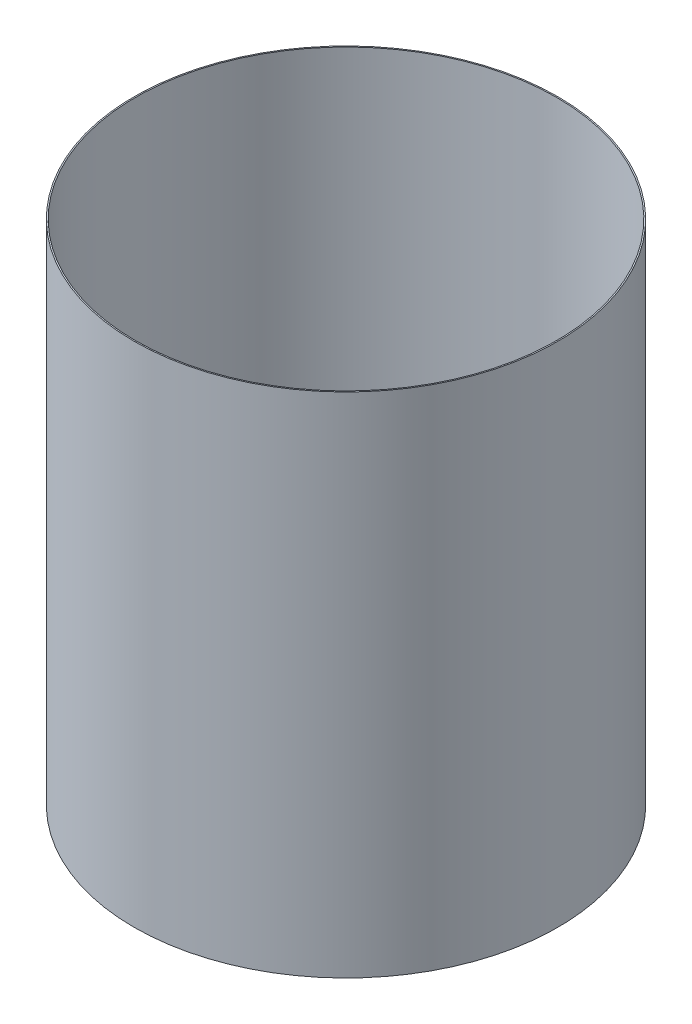
ISO-10303-21;
HEADER;
FILE_DESCRIPTION(('STEP AP214'),'2;1');
FILE_NAME('part.step','',(''),(''),'','','');
FILE_SCHEMA(('AUTOMOTIVE_DESIGN { 1 0 10303 214 1 1 1 1 }'));
ENDSEC;
DATA;
#1=APPLICATION_CONTEXT('core data for automotive mechanical design processes');
#2=APPLICATION_PROTOCOL_DEFINITION('international standard','automotive_design',2000,#1);
#3=PRODUCT_CONTEXT('',#1,'mechanical');
#4=PRODUCT('Part','Part','',(#3));
#5=PRODUCT_RELATED_PRODUCT_CATEGORY('part','',(#4));
#6=PRODUCT_DEFINITION_FORMATION('','',#4);
#7=PRODUCT_DEFINITION_CONTEXT('part definition',#1,'design');
#8=PRODUCT_DEFINITION('design','',#6,#7);
#9=PRODUCT_DEFINITION_SHAPE('','',#8);
#10=(LENGTH_UNIT() NAMED_UNIT(*) SI_UNIT(.MILLI.,.METRE.));
#11=(NAMED_UNIT(*) PLANE_ANGLE_UNIT() SI_UNIT($,.RADIAN.));
#12=(NAMED_UNIT(*) SI_UNIT($,.STERADIAN.) SOLID_ANGLE_UNIT());
#13=UNCERTAINTY_MEASURE_WITH_UNIT(LENGTH_MEASURE(1.E-05),#10,'distance_accuracy_value','');
#14=(GEOMETRIC_REPRESENTATION_CONTEXT(3) GLOBAL_UNCERTAINTY_ASSIGNED_CONTEXT((#13)) GLOBAL_UNIT_ASSIGNED_CONTEXT((#10,
#11,#12)) REPRESENTATION_CONTEXT('',''));
#15=CARTESIAN_POINT('',(0.,0.,0.));
#16=DIRECTION('',(0.,0.,1.));
#17=DIRECTION('',(1.,0.,0.));
#18=AXIS2_PLACEMENT_3D('',#15,#16,#17);
#19=CARTESIAN_POINT('',(0.,0.,0.));
#20=DIRECTION('',(0.,1.,0.));
#21=DIRECTION('',(0.,0.,1.));
#22=AXIS2_PLACEMENT_3D('',#19,#20,#21);
#23=CYLINDRICAL_SURFACE('',#22,21.082);
#24=CARTESIAN_POINT('',(0.,50.8,0.));
#25=DIRECTION('',(0.,1.,0.));
#26=DIRECTION('',(0.,0.,1.));
#27=AXIS2_PLACEMENT_3D('',#24,#25,#26);
#28=CIRCLE('',#27,21.082);
#29=CARTESIAN_POINT('',(0.,50.8,21.082));
#30=VERTEX_POINT('',#29);
#31=EDGE_CURVE('E17',#30,#30,#28,.F.);
#32=ORIENTED_EDGE('',*,*,#31,.F.);
#33=EDGE_LOOP('',(#32));
#34=FACE_BOUND('',#33,.T.);
#35=CARTESIAN_POINT('',(0.,0.,0.));
#36=DIRECTION('',(0.,1.,0.));
#37=DIRECTION('',(0.,0.,1.));
#38=AXIS2_PLACEMENT_3D('',#35,#36,#37);
#39=CIRCLE('',#38,21.082);
#40=CARTESIAN_POINT('',(0.,0.,21.082));
#41=VERTEX_POINT('',#40);
#42=EDGE_CURVE('E26',#41,#41,#39,.F.);
#43=ORIENTED_EDGE('',*,*,#42,.T.);
#44=EDGE_LOOP('',(#43));
#45=FACE_BOUND('',#44,.T.);
#46=ADVANCED_FACE('F14',(#34,#45),#23,.F.);
#47=CARTESIAN_POINT('',(0.,50.8,0.));
#48=DIRECTION('',(0.,1.,0.));
#49=DIRECTION('',(0.,0.,1.));
#50=AXIS2_PLACEMENT_3D('',#47,#48,#49);
#51=PLANE('',#50);
#52=ORIENTED_EDGE('',*,*,#31,.T.);
#53=EDGE_LOOP('',(#52));
#54=FACE_BOUND('',#53,.T.);
#55=CARTESIAN_POINT('',(0.,50.8,0.));
#56=DIRECTION('',(0.,1.,0.));
#57=DIRECTION('',(0.,0.,1.));
#58=AXIS2_PLACEMENT_3D('',#55,#56,#57);
#59=CIRCLE('',#58,21.209);
#60=CARTESIAN_POINT('',(0.,50.8,21.209));
#61=VERTEX_POINT('',#60);
#62=EDGE_CURVE('E21',#61,#61,#59,.F.);
#63=ORIENTED_EDGE('',*,*,#62,.F.);
#64=EDGE_LOOP('',(#63));
#65=FACE_BOUND('',#64,.T.);
#66=ADVANCED_FACE('F34',(#54,#65),#51,.T.);
#67=CARTESIAN_POINT('',(0.,0.,0.));
#68=DIRECTION('',(0.,1.,0.));
#69=DIRECTION('',(0.,0.,1.));
#70=AXIS2_PLACEMENT_3D('',#67,#68,#69);
#71=PLANE('',#70);
#72=ORIENTED_EDGE('',*,*,#42,.F.);
#73=EDGE_LOOP('',(#72));
#74=FACE_BOUND('',#73,.T.);
#75=CARTESIAN_POINT('',(0.,0.,0.));
#76=DIRECTION('',(0.,1.,0.));
#77=DIRECTION('',(0.,0.,1.));
#78=AXIS2_PLACEMENT_3D('',#75,#76,#77);
#79=CIRCLE('',#78,21.209);
#80=CARTESIAN_POINT('',(0.,0.,21.209));
#81=VERTEX_POINT('',#80);
#82=EDGE_CURVE('E10',#81,#81,#79,.T.);
#83=ORIENTED_EDGE('',*,*,#82,.F.);
#84=EDGE_LOOP('',(#83));
#85=FACE_BOUND('',#84,.T.);
#86=ADVANCED_FACE('F42',(#74,#85),#71,.F.);
#87=CARTESIAN_POINT('',(0.,0.,0.));
#88=DIRECTION('',(0.,1.,0.));
#89=DIRECTION('',(0.,0.,1.));
#90=AXIS2_PLACEMENT_3D('',#87,#88,#89);
#91=CYLINDRICAL_SURFACE('',#90,21.209);
#92=ORIENTED_EDGE('',*,*,#62,.T.);
#93=EDGE_LOOP('',(#92));
#94=FACE_BOUND('',#93,.T.);
#95=ORIENTED_EDGE('',*,*,#82,.T.);
#96=EDGE_LOOP('',(#95));
#97=FACE_BOUND('',#96,.T.);
#98=ADVANCED_FACE('F43',(#94,#97),#91,.T.);
#99=CLOSED_SHELL('',(#46,#66,#86,#98));
#100=MANIFOLD_SOLID_BREP('B1',#99);
#101=ADVANCED_BREP_SHAPE_REPRESENTATION('',(#18,#100),#14);
#102=SHAPE_DEFINITION_REPRESENTATION(#9,#101);
ENDSEC;
END-ISO-10303-21;
